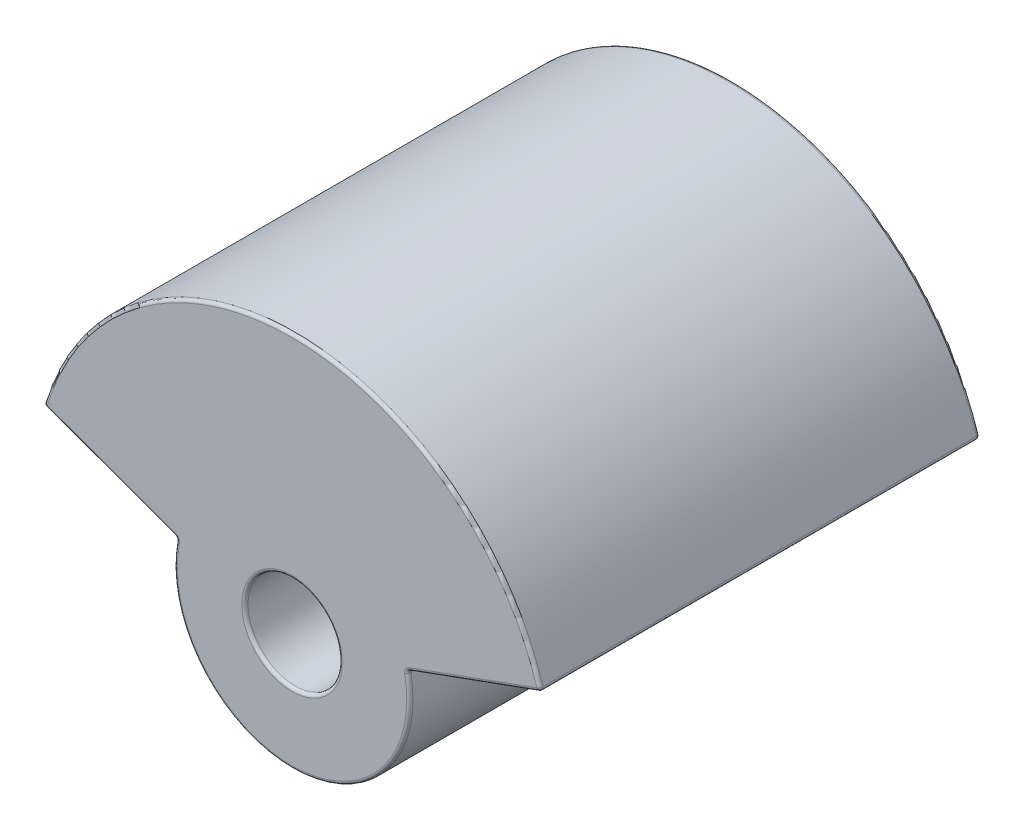
ISO-10303-21;
HEADER;
FILE_DESCRIPTION(('STEP AP214'),'2;1');
FILE_NAME('part.step','',(''),(''),'','','');
FILE_SCHEMA(('AUTOMOTIVE_DESIGN { 1 0 10303 214 1 1 1 1 }'));
ENDSEC;
DATA;
#1=APPLICATION_CONTEXT('core data for automotive mechanical design processes');
#2=APPLICATION_PROTOCOL_DEFINITION('international standard','automotive_design',2000,#1);
#3=PRODUCT_CONTEXT('',#1,'mechanical');
#4=PRODUCT('Part','Part','',(#3));
#5=PRODUCT_RELATED_PRODUCT_CATEGORY('part','',(#4));
#6=PRODUCT_DEFINITION_FORMATION('','',#4);
#7=PRODUCT_DEFINITION_CONTEXT('part definition',#1,'design');
#8=PRODUCT_DEFINITION('design','',#6,#7);
#9=PRODUCT_DEFINITION_SHAPE('','',#8);
#10=(LENGTH_UNIT() NAMED_UNIT(*) SI_UNIT(.MILLI.,.METRE.));
#11=(NAMED_UNIT(*) PLANE_ANGLE_UNIT() SI_UNIT($,.RADIAN.));
#12=(NAMED_UNIT(*) SI_UNIT($,.STERADIAN.) SOLID_ANGLE_UNIT());
#13=UNCERTAINTY_MEASURE_WITH_UNIT(LENGTH_MEASURE(1.E-05),#10,'distance_accuracy_value','');
#14=(GEOMETRIC_REPRESENTATION_CONTEXT(3) GLOBAL_UNCERTAINTY_ASSIGNED_CONTEXT((#13)) GLOBAL_UNIT_ASSIGNED_CONTEXT((#10,
#11,#12)) REPRESENTATION_CONTEXT('',''));
#15=CARTESIAN_POINT('',(0.,0.,0.));
#16=DIRECTION('',(0.,0.,1.));
#17=DIRECTION('',(1.,0.,0.));
#18=AXIS2_PLACEMENT_3D('',#15,#16,#17);
#19=CARTESIAN_POINT('',(0.,0.,0.));
#20=DIRECTION('',(0.,0.,1.));
#21=DIRECTION('',(1.,0.,0.));
#22=AXIS2_PLACEMENT_3D('',#19,#20,#21);
#23=PLANE('',#22);
#24=CARTESIAN_POINT('',(0.,0.,0.));
#25=DIRECTION('',(0.,0.,1.));
#26=DIRECTION('',(1.,0.,0.));
#27=AXIS2_PLACEMENT_3D('',#24,#25,#26);
#28=CIRCLE('',#27,0.32);
#29=CARTESIAN_POINT('',(0.32,0.,0.));
#30=VERTEX_POINT('',#29);
#31=EDGE_CURVE('E245',#30,#30,#28,.F.);
#32=ORIENTED_EDGE('',*,*,#31,.T.);
#33=EDGE_LOOP('',(#32));
#34=FACE_BOUND('',#33,.T.);
#35=CARTESIAN_POINT('',(-0.75626564218996,0.144783557225976,0.));
#36=DIRECTION('',(0.,0.,1.));
#37=DIRECTION('',(1.,0.,0.));
#38=AXIS2_PLACEMENT_3D('',#35,#36,#37);
#39=CIRCLE('',#38,0.04);
#40=CARTESIAN_POINT('',(-0.716979115322949,0.137262333473978,0.));
#41=VERTEX_POINT('',#40);
#42=CARTESIAN_POINT('',(-0.742584836456934,0.182371262057413,0.));
#43=VERTEX_POINT('',#42);
#44=EDGE_CURVE('E241',#41,#43,#39,.T.);
#45=ORIENTED_EDGE('',*,*,#44,.F.);
#46=CARTESIAN_POINT('',(0.,0.,0.));
#47=DIRECTION('',(0.,0.,1.));
#48=DIRECTION('',(1.,0.,0.));
#49=AXIS2_PLACEMENT_3D('',#46,#47,#48);
#50=CIRCLE('',#49,0.73);
#51=CARTESIAN_POINT('',(0.716979115322948,0.137262333473982,0.));
#52=VERTEX_POINT('',#51);
#53=EDGE_CURVE('E237',#41,#52,#50,.T.);
#54=ORIENTED_EDGE('',*,*,#53,.T.);
#55=CARTESIAN_POINT('',(0.756265642189959,0.144783557225981,0.));
#56=DIRECTION('',(0.,0.,1.));
#57=DIRECTION('',(1.,0.,0.));
#58=AXIS2_PLACEMENT_3D('',#55,#56,#57);
#59=CIRCLE('',#58,0.04);
#60=CARTESIAN_POINT('',(0.742584836456932,0.182371262057418,0.));
#61=VERTEX_POINT('',#60);
#62=EDGE_CURVE('E234',#61,#52,#59,.T.);
#63=ORIENTED_EDGE('',*,*,#62,.F.);
#64=DIRECTION('',(0.939692620785908,0.342020143325669,0.));
#65=VECTOR('',#64,1.);
#66=CARTESIAN_POINT('',(0.02825293066564,-0.0776242890372621,0.));
#67=LINE('',#66,#65);
#68=CARTESIAN_POINT('',(1.557983694628,0.479152175486335,0.));
#69=VERTEX_POINT('',#68);
#70=EDGE_CURVE('E231',#61,#69,#67,.T.);
#71=ORIENTED_EDGE('',*,*,#70,.T.);
#72=CARTESIAN_POINT('',(0.,0.,0.));
#73=DIRECTION('',(0.,0.,1.));
#74=DIRECTION('',(1.,0.,0.));
#75=AXIS2_PLACEMENT_3D('',#72,#73,#74);
#76=CIRCLE('',#75,1.63);
#77=CARTESIAN_POINT('',(-1.557983694628,0.479152175486324,0.));
#78=VERTEX_POINT('',#77);
#79=EDGE_CURVE('E225',#69,#78,#76,.T.);
#80=ORIENTED_EDGE('',*,*,#79,.T.);
#81=DIRECTION('',(0.939692620785911,-0.342020143325662,0.));
#82=VECTOR('',#81,1.);
#83=CARTESIAN_POINT('',(-0.0282529306656392,-0.0776242890372618,0.));
#84=LINE('',#83,#82);
#85=EDGE_CURVE('E228',#78,#43,#84,.T.);
#86=ORIENTED_EDGE('',*,*,#85,.T.);
#87=EDGE_LOOP('',(#45,#54,#63,#71,#80,#86));
#88=FACE_BOUND('',#87,.T.);
#89=ADVANCED_FACE('F42',(#34,#88),#23,.T.);
#90=CARTESIAN_POINT('',(0.,0.,-2.8));
#91=DIRECTION('',(0.,0.,1.));
#92=DIRECTION('',(1.,0.,0.));
#93=AXIS2_PLACEMENT_3D('',#90,#91,#92);
#94=PLANE('',#93);
#95=CARTESIAN_POINT('',(0.,0.,-2.8));
#96=DIRECTION('',(0.,0.,1.));
#97=DIRECTION('',(1.,0.,0.));
#98=AXIS2_PLACEMENT_3D('',#95,#96,#97);
#99=CIRCLE('',#98,0.32);
#100=CARTESIAN_POINT('',(0.32,0.,-2.8));
#101=VERTEX_POINT('',#100);
#102=EDGE_CURVE('E208',#101,#101,#99,.T.);
#103=ORIENTED_EDGE('',*,*,#102,.T.);
#104=EDGE_LOOP('',(#103));
#105=FACE_BOUND('',#104,.T.);
#106=CARTESIAN_POINT('',(0.756265642189959,0.144783557225981,-2.8));
#107=DIRECTION('',(0.,0.,1.));
#108=DIRECTION('',(1.,0.,0.));
#109=AXIS2_PLACEMENT_3D('',#106,#107,#108);
#110=CIRCLE('',#109,0.04);
#111=CARTESIAN_POINT('',(0.716979115322948,0.137262333473982,-2.8));
#112=VERTEX_POINT('',#111);
#113=CARTESIAN_POINT('',(0.742584836456932,0.182371262057418,-2.8));
#114=VERTEX_POINT('',#113);
#115=EDGE_CURVE('E205',#112,#114,#110,.F.);
#116=ORIENTED_EDGE('',*,*,#115,.F.);
#117=CARTESIAN_POINT('',(0.,0.,-2.8));
#118=DIRECTION('',(0.,0.,1.));
#119=DIRECTION('',(1.,0.,0.));
#120=AXIS2_PLACEMENT_3D('',#117,#118,#119);
#121=CIRCLE('',#120,0.73);
#122=CARTESIAN_POINT('',(-0.716979115322949,0.137262333473978,-2.8));
#123=VERTEX_POINT('',#122);
#124=EDGE_CURVE('E152',#112,#123,#121,.F.);
#125=ORIENTED_EDGE('',*,*,#124,.T.);
#126=CARTESIAN_POINT('',(-0.75626564218996,0.144783557225976,-2.8));
#127=DIRECTION('',(0.,0.,1.));
#128=DIRECTION('',(1.,0.,0.));
#129=AXIS2_PLACEMENT_3D('',#126,#127,#128);
#130=CIRCLE('',#129,0.04);
#131=CARTESIAN_POINT('',(-0.742584836456934,0.182371262057413,-2.8));
#132=VERTEX_POINT('',#131);
#133=EDGE_CURVE('E199',#132,#123,#130,.F.);
#134=ORIENTED_EDGE('',*,*,#133,.F.);
#135=DIRECTION('',(0.939692620785911,-0.342020143325662,0.));
#136=VECTOR('',#135,1.);
#137=CARTESIAN_POINT('',(-1.57574494686297,0.485616742623145,-2.8));
#138=LINE('',#137,#136);
#139=CARTESIAN_POINT('',(-1.557983694628,0.479152175486324,-2.8));
#140=VERTEX_POINT('',#139);
#141=EDGE_CURVE('E189',#132,#140,#138,.F.);
#142=ORIENTED_EDGE('',*,*,#141,.T.);
#143=CARTESIAN_POINT('',(0.,0.,-2.8));
#144=DIRECTION('',(0.,0.,1.));
#145=DIRECTION('',(1.,0.,0.));
#146=AXIS2_PLACEMENT_3D('',#143,#144,#145);
#147=CIRCLE('',#146,1.63);
#148=CARTESIAN_POINT('',(1.557983694628,0.479152175486335,-2.8));
#149=VERTEX_POINT('',#148);
#150=EDGE_CURVE('E185',#140,#149,#147,.F.);
#151=ORIENTED_EDGE('',*,*,#150,.T.);
#152=DIRECTION('',(0.939692620785908,0.342020143325669,0.));
#153=VECTOR('',#152,1.);
#154=CARTESIAN_POINT('',(0.726395854160511,0.176478954378458,-2.8));
#155=LINE('',#154,#153);
#156=EDGE_CURVE('E196',#149,#114,#155,.F.);
#157=ORIENTED_EDGE('',*,*,#156,.T.);
#158=EDGE_LOOP('',(#116,#125,#134,#142,#151,#157));
#159=FACE_BOUND('',#158,.T.);
#160=ADVANCED_FACE('F432',(#105,#159),#94,.F.);
#161=CARTESIAN_POINT('',(0.,0.,-2.8));
#162=DIRECTION('',(0.,0.,1.));
#163=DIRECTION('',(1.,0.,0.));
#164=AXIS2_PLACEMENT_3D('',#161,#162,#163);
#165=CYLINDRICAL_SURFACE('',#164,1.65);
#166=CARTESIAN_POINT('',(0.,0.,-0.0200000000000001));
#167=DIRECTION('',(0.,0.,1.));
#168=DIRECTION('',(1.,0.,0.));
#169=AXIS2_PLACEMENT_3D('',#166,#167,#168);
#170=CIRCLE('',#169,1.65);
#171=CARTESIAN_POINT('',(-1.57710005897927,0.485031343283702,-0.0200000000000001));
#172=VERTEX_POINT('',#171);
#173=CARTESIAN_POINT('',(1.57710005897926,0.485031343283714,-0.0200000000000001));
#174=VERTEX_POINT('',#173);
#175=EDGE_CURVE('E60',#172,#174,#170,.F.);
#176=ORIENTED_EDGE('',*,*,#175,.T.);
#177=DIRECTION('',(0.,0.,1.));
#178=VECTOR('',#177,1.);
#179=CARTESIAN_POINT('',(1.57710005897926,0.485031343283714,-2.8));
#180=LINE('',#179,#178);
#181=CARTESIAN_POINT('',(1.57710005897926,0.485031343283714,-2.78));
#182=VERTEX_POINT('',#181);
#183=EDGE_CURVE('E269',#174,#182,#180,.F.);
#184=ORIENTED_EDGE('',*,*,#183,.T.);
#185=CARTESIAN_POINT('',(0.,0.,-2.78));
#186=DIRECTION('',(0.,0.,1.));
#187=DIRECTION('',(1.,0.,0.));
#188=AXIS2_PLACEMENT_3D('',#185,#186,#187);
#189=CIRCLE('',#188,1.65);
#190=CARTESIAN_POINT('',(-1.57710005897927,0.485031343283702,-2.78));
#191=VERTEX_POINT('',#190);
#192=EDGE_CURVE('E262',#182,#191,#189,.T.);
#193=ORIENTED_EDGE('',*,*,#192,.T.);
#194=DIRECTION('',(0.,0.,1.));
#195=VECTOR('',#194,1.);
#196=CARTESIAN_POINT('',(-1.57710005897927,0.485031343283702,-2.8));
#197=LINE('',#196,#195);
#198=EDGE_CURVE('E65',#191,#172,#197,.T.);
#199=ORIENTED_EDGE('',*,*,#198,.T.);
#200=EDGE_LOOP('',(#176,#184,#193,#199));
#201=FACE_BOUND('',#200,.T.);
#202=ADVANCED_FACE('F386',(#201),#165,.T.);
#203=CARTESIAN_POINT('',(0.733236257027025,0.15768510196274,-2.8));
#204=DIRECTION('',(0.342020143325669,-0.939692620785908,0.));
#205=DIRECTION('',(0.939692620785908,0.342020143325669,0.));
#206=AXIS2_PLACEMENT_3D('',#203,#204,#205);
#207=PLANE('',#206);
#208=DIRECTION('',(0.939692620785908,0.342020143325669,0.));
#209=VECTOR('',#208,1.);
#210=CARTESIAN_POINT('',(1.58258534972948,0.466822890207438,-2.78));
#211=LINE('',#210,#209);
#212=CARTESIAN_POINT('',(0.749425239323446,0.1635774096417,-2.78));
#213=VERTEX_POINT('',#212);
#214=CARTESIAN_POINT('',(1.56482409749451,0.460358323070617,-2.78));
#215=VERTEX_POINT('',#214);
#216=EDGE_CURVE('E255',#213,#215,#211,.T.);
#217=ORIENTED_EDGE('',*,*,#216,.T.);
#218=DIRECTION('',(0.,0.,1.));
#219=VECTOR('',#218,1.);
#220=CARTESIAN_POINT('',(1.56482409749451,0.460358323070617,-2.8));
#221=LINE('',#220,#219);
#222=CARTESIAN_POINT('',(1.56482409749451,0.460358323070617,-0.02));
#223=VERTEX_POINT('',#222);
#224=EDGE_CURVE('E258',#215,#223,#221,.T.);
#225=ORIENTED_EDGE('',*,*,#224,.T.);
#226=DIRECTION('',(0.939692620785908,0.342020143325669,0.));
#227=VECTOR('',#226,1.);
#228=CARTESIAN_POINT('',(0.733236257027025,0.15768510196274,-0.0200000000000001));
#229=LINE('',#228,#227);
#230=CARTESIAN_POINT('',(0.749425239323446,0.1635774096417,-0.02));
#231=VERTEX_POINT('',#230);
#232=EDGE_CURVE('E249',#223,#231,#229,.F.);
#233=ORIENTED_EDGE('',*,*,#232,.T.);
#234=DIRECTION('',(0.,0.,-1.));
#235=VECTOR('',#234,1.);
#236=CARTESIAN_POINT('',(0.749425239323446,0.1635774096417,-2.8));
#237=LINE('',#236,#235);
#238=EDGE_CURVE('E252',#231,#213,#237,.T.);
#239=ORIENTED_EDGE('',*,*,#238,.T.);
#240=EDGE_LOOP('',(#217,#225,#233,#239));
#241=FACE_BOUND('',#240,.T.);
#242=ADVANCED_FACE('F417',(#241),#207,.T.);
#243=CARTESIAN_POINT('',(0.,0.,-2.8));
#244=DIRECTION('',(0.,0.,1.));
#245=DIRECTION('',(1.,0.,0.));
#246=AXIS2_PLACEMENT_3D('',#243,#244,#245);
#247=CYLINDRICAL_SURFACE('',#246,0.75);
#248=DIRECTION('',(0.,0.,1.));
#249=VECTOR('',#248,1.);
#250=CARTESIAN_POINT('',(-0.736622378756455,0.141022945349977,-2.8));
#251=LINE('',#250,#249);
#252=CARTESIAN_POINT('',(-0.736622378756455,0.141022945349977,-0.0200000000000001));
#253=VERTEX_POINT('',#252);
#254=CARTESIAN_POINT('',(-0.736622378756455,0.141022945349977,-2.78));
#255=VERTEX_POINT('',#254);
#256=EDGE_CURVE('E182',#253,#255,#251,.F.);
#257=ORIENTED_EDGE('',*,*,#256,.T.);
#258=CARTESIAN_POINT('',(0.,0.,-2.78));
#259=DIRECTION('',(0.,0.,1.));
#260=DIRECTION('',(1.,0.,0.));
#261=AXIS2_PLACEMENT_3D('',#258,#259,#260);
#262=CIRCLE('',#261,0.75);
#263=CARTESIAN_POINT('',(0.736622378756454,0.141022945349982,-2.78));
#264=VERTEX_POINT('',#263);
#265=EDGE_CURVE('E150',#255,#264,#262,.T.);
#266=ORIENTED_EDGE('',*,*,#265,.T.);
#267=DIRECTION('',(0.,0.,1.));
#268=VECTOR('',#267,1.);
#269=CARTESIAN_POINT('',(0.736622378756454,0.141022945349982,-2.8));
#270=LINE('',#269,#268);
#271=CARTESIAN_POINT('',(0.736622378756454,0.141022945349982,-0.0200000000000001));
#272=VERTEX_POINT('',#271);
#273=EDGE_CURVE('E171',#264,#272,#270,.T.);
#274=ORIENTED_EDGE('',*,*,#273,.T.);
#275=CARTESIAN_POINT('',(0.,0.,-0.0200000000000001));
#276=DIRECTION('',(0.,0.,1.));
#277=DIRECTION('',(1.,0.,0.));
#278=AXIS2_PLACEMENT_3D('',#275,#276,#277);
#279=CIRCLE('',#278,0.75);
#280=EDGE_CURVE('E178',#272,#253,#279,.F.);
#281=ORIENTED_EDGE('',*,*,#280,.T.);
#282=EDGE_LOOP('',(#257,#266,#274,#281));
#283=FACE_BOUND('',#282,.T.);
#284=ADVANCED_FACE('F180',(#283),#247,.T.);
#285=CARTESIAN_POINT('',(-0.733236257027026,0.157685101962735,-2.8));
#286=DIRECTION('',(-0.342020143325662,-0.939692620785911,0.));
#287=DIRECTION('',(0.939692620785911,-0.342020143325662,0.));
#288=AXIS2_PLACEMENT_3D('',#285,#286,#287);
#289=PLANE('',#288);
#290=DIRECTION('',(0.939692620785911,-0.342020143325662,0.));
#291=VECTOR('',#290,1.);
#292=CARTESIAN_POINT('',(-0.733236257027026,0.157685101962735,-2.78));
#293=LINE('',#292,#291);
#294=CARTESIAN_POINT('',(-1.56482409749452,0.460358323070606,-2.78));
#295=VERTEX_POINT('',#294);
#296=CARTESIAN_POINT('',(-0.749425239323447,0.163577409641695,-2.78));
#297=VERTEX_POINT('',#296);
#298=EDGE_CURVE('E212',#295,#297,#293,.T.);
#299=ORIENTED_EDGE('',*,*,#298,.T.);
#300=DIRECTION('',(0.,0.,-1.));
#301=VECTOR('',#300,1.);
#302=CARTESIAN_POINT('',(-0.749425239323447,0.163577409641695,0.));
#303=LINE('',#302,#301);
#304=CARTESIAN_POINT('',(-0.749425239323447,0.163577409641695,-0.02));
#305=VERTEX_POINT('',#304);
#306=EDGE_CURVE('E221',#297,#305,#303,.F.);
#307=ORIENTED_EDGE('',*,*,#306,.T.);
#308=DIRECTION('',(0.939692620785911,-0.342020143325662,0.));
#309=VECTOR('',#308,1.);
#310=CARTESIAN_POINT('',(-0.733236257027026,0.157685101962735,-0.0200000000000001));
#311=LINE('',#310,#309);
#312=CARTESIAN_POINT('',(-1.56482409749452,0.460358323070606,-0.02));
#313=VERTEX_POINT('',#312);
#314=EDGE_CURVE('E218',#305,#313,#311,.F.);
#315=ORIENTED_EDGE('',*,*,#314,.T.);
#316=DIRECTION('',(0.,0.,1.));
#317=VECTOR('',#316,1.);
#318=CARTESIAN_POINT('',(-1.56482409749452,0.460358323070606,-2.8));
#319=LINE('',#318,#317);
#320=EDGE_CURVE('E215',#313,#295,#319,.F.);
#321=ORIENTED_EDGE('',*,*,#320,.T.);
#322=EDGE_LOOP('',(#299,#307,#315,#321));
#323=FACE_BOUND('',#322,.T.);
#324=ADVANCED_FACE('F368',(#323),#289,.T.);
#325=CARTESIAN_POINT('',(0.,0.,-2.8));
#326=DIRECTION('',(0.,0.,1.));
#327=DIRECTION('',(1.,0.,0.));
#328=AXIS2_PLACEMENT_3D('',#325,#326,#327);
#329=CYLINDRICAL_SURFACE('',#328,0.3);
#330=CARTESIAN_POINT('',(0.,0.,-0.0200000000000001));
#331=DIRECTION('',(0.,0.,1.));
#332=DIRECTION('',(1.,0.,0.));
#333=AXIS2_PLACEMENT_3D('',#330,#331,#332);
#334=CIRCLE('',#333,0.3);
#335=CARTESIAN_POINT('',(0.3,0.,-0.0200000000000001));
#336=VERTEX_POINT('',#335);
#337=EDGE_CURVE('E11',#336,#336,#334,.T.);
#338=ORIENTED_EDGE('',*,*,#337,.T.);
#339=EDGE_LOOP('',(#338));
#340=FACE_BOUND('',#339,.T.);
#341=CARTESIAN_POINT('',(0.,0.,-2.78));
#342=DIRECTION('',(0.,0.,1.));
#343=DIRECTION('',(1.,0.,0.));
#344=AXIS2_PLACEMENT_3D('',#341,#342,#343);
#345=CIRCLE('',#344,0.3);
#346=CARTESIAN_POINT('',(0.3,0.,-2.78));
#347=VERTEX_POINT('',#346);
#348=EDGE_CURVE('E52',#347,#347,#345,.F.);
#349=ORIENTED_EDGE('',*,*,#348,.T.);
#350=EDGE_LOOP('',(#349));
#351=FACE_BOUND('',#350,.T.);
#352=ADVANCED_FACE('F448',(#340,#351),#329,.F.);
#353=CARTESIAN_POINT('',(0.,0.,-0.0200000000000001));
#354=DIRECTION('',(0.,0.,1.));
#355=DIRECTION('',(1.,0.,0.));
#356=AXIS2_PLACEMENT_3D('',#353,#354,#355);
#357=TOROIDAL_SURFACE('',#356,1.63,0.02);
#358=CARTESIAN_POINT('',(-1.557983694628,0.479152175486324,-0.02));
#359=DIRECTION('',(-0.293958389868907,-0.955818217563193,0.));
#360=DIRECTION('',(0.955818217563193,-0.293958389868907,0.));
#361=AXIS2_PLACEMENT_3D('',#358,#359,#360);
#362=CIRCLE('',#361,0.02);
#363=EDGE_CURVE('E46',#78,#172,#362,.T.);
#364=ORIENTED_EDGE('',*,*,#363,.F.);
#365=ORIENTED_EDGE('',*,*,#79,.F.);
#366=CARTESIAN_POINT('',(1.557983694628,0.479152175486335,-0.0200000000000001));
#367=DIRECTION('',(0.293958389868917,-0.95581821756319,0.));
#368=DIRECTION('',(0.95581821756319,0.293958389868917,0.));
#369=AXIS2_PLACEMENT_3D('',#366,#367,#368);
#370=CIRCLE('',#369,0.02);
#371=EDGE_CURVE('E345',#174,#69,#370,.T.);
#372=ORIENTED_EDGE('',*,*,#371,.F.);
#373=ORIENTED_EDGE('',*,*,#175,.F.);
#374=EDGE_LOOP('',(#364,#365,#372,#373));
#375=FACE_BOUND('',#374,.T.);
#376=ADVANCED_FACE('F378',(#375),#357,.T.);
#377=CARTESIAN_POINT('',(-1.557983694628,0.479152175486324,-0.02));
#378=DIRECTION('',(0.,0.,1.));
#379=DIRECTION('',(0.,-1.,0.));
#380=AXIS2_PLACEMENT_3D('',#377,#378,#379);
#381=SPHERICAL_SURFACE('',#380,0.02);
#382=CARTESIAN_POINT('',(-1.557983694628,0.479152175486324,-0.02));
#383=DIRECTION('',(-0.93969262078591,0.342020143325665,0.));
#384=DIRECTION('',(-0.342020143325665,-0.93969262078591,0.));
#385=AXIS2_PLACEMENT_3D('',#382,#383,#384);
#386=CIRCLE('',#385,0.02);
#387=EDGE_CURVE('E338',#78,#313,#386,.F.);
#388=ORIENTED_EDGE('',*,*,#387,.F.);
#389=ORIENTED_EDGE('',*,*,#363,.T.);
#390=CARTESIAN_POINT('',(-1.557983694628,0.479152175486324,-0.0200000000000001));
#391=DIRECTION('',(0.,0.,1.));
#392=DIRECTION('',(0.,-1.,0.));
#393=AXIS2_PLACEMENT_3D('',#390,#391,#392);
#394=CIRCLE('',#393,0.02);
#395=EDGE_CURVE('E342',#313,#172,#394,.F.);
#396=ORIENTED_EDGE('',*,*,#395,.F.);
#397=EDGE_LOOP('',(#388,#389,#396));
#398=FACE_BOUND('',#397,.T.);
#399=ADVANCED_FACE('F357',(#398),#381,.T.);
#400=CARTESIAN_POINT('',(1.557983694628,0.479152175486335,-0.02));
#401=DIRECTION('',(0.,0.,1.));
#402=DIRECTION('',(0.,-1.,0.));
#403=AXIS2_PLACEMENT_3D('',#400,#401,#402);
#404=SPHERICAL_SURFACE('',#403,0.02);
#405=CARTESIAN_POINT('',(1.557983694628,0.479152175486335,-0.02));
#406=DIRECTION('',(0.,0.,1.));
#407=DIRECTION('',(1.,0.,0.));
#408=AXIS2_PLACEMENT_3D('',#405,#406,#407);
#409=CIRCLE('',#408,0.02);
#410=EDGE_CURVE('E330',#174,#223,#409,.F.);
#411=ORIENTED_EDGE('',*,*,#410,.F.);
#412=ORIENTED_EDGE('',*,*,#371,.T.);
#413=CARTESIAN_POINT('',(1.557983694628,0.479152175486335,-0.02));
#414=DIRECTION('',(0.939692620785914,0.342020143325654,0.));
#415=DIRECTION('',(-0.342020143325654,0.939692620785914,0.));
#416=AXIS2_PLACEMENT_3D('',#413,#414,#415);
#417=CIRCLE('',#416,0.02);
#418=EDGE_CURVE('E334',#223,#69,#417,.F.);
#419=ORIENTED_EDGE('',*,*,#418,.F.);
#420=EDGE_LOOP('',(#411,#412,#419));
#421=FACE_BOUND('',#420,.T.);
#422=ADVANCED_FACE('F380',(#421),#404,.T.);
#423=CARTESIAN_POINT('',(-1.557983694628,0.479152175486324,-2.8));
#424=DIRECTION('',(0.,0.,1.));
#425=DIRECTION('',(1.,0.,0.));
#426=AXIS2_PLACEMENT_3D('',#423,#424,#425);
#427=CYLINDRICAL_SURFACE('',#426,0.02);
#428=ORIENTED_EDGE('',*,*,#395,.T.);
#429=ORIENTED_EDGE('',*,*,#198,.F.);
#430=CARTESIAN_POINT('',(-1.557983694628,0.479152175486324,-2.78));
#431=DIRECTION('',(0.,0.,-1.));
#432=DIRECTION('',(-1.,0.,0.));
#433=AXIS2_PLACEMENT_3D('',#430,#431,#432);
#434=CIRCLE('',#433,0.02);
#435=EDGE_CURVE('E322',#295,#191,#434,.T.);
#436=ORIENTED_EDGE('',*,*,#435,.F.);
#437=ORIENTED_EDGE('',*,*,#320,.F.);
#438=EDGE_LOOP('',(#428,#429,#436,#437));
#439=FACE_BOUND('',#438,.T.);
#440=ADVANCED_FACE('F363',(#439),#427,.T.);
#441=CARTESIAN_POINT('',(-0.0282529306656392,-0.0776242890372618,-0.02));
#442=DIRECTION('',(0.939692620785911,-0.342020143325662,0.));
#443=DIRECTION('',(0.342020143325662,0.939692620785911,0.));
#444=AXIS2_PLACEMENT_3D('',#441,#442,#443);
#445=CYLINDRICAL_SURFACE('',#444,0.02);
#446=ORIENTED_EDGE('',*,*,#387,.T.);
#447=ORIENTED_EDGE('',*,*,#314,.F.);
#448=CARTESIAN_POINT('',(-0.742584836456934,0.182371262057413,-0.02));
#449=DIRECTION('',(0.93969262078591,-0.342020143325664,0.));
#450=DIRECTION('',(0.342020143325664,0.93969262078591,0.));
#451=AXIS2_PLACEMENT_3D('',#448,#449,#450);
#452=CIRCLE('',#451,0.02);
#453=EDGE_CURVE('E318',#43,#305,#452,.T.);
#454=ORIENTED_EDGE('',*,*,#453,.F.);
#455=ORIENTED_EDGE('',*,*,#85,.F.);
#456=EDGE_LOOP('',(#446,#447,#454,#455));
#457=FACE_BOUND('',#456,.T.);
#458=ADVANCED_FACE('F374',(#457),#445,.T.);
#459=CARTESIAN_POINT('',(0.,0.,-0.0200000000000001));
#460=DIRECTION('',(0.,0.,1.));
#461=DIRECTION('',(1.,0.,0.));
#462=AXIS2_PLACEMENT_3D('',#459,#460,#461);
#463=TOROIDAL_SURFACE('',#462,0.73,0.02);
#464=CARTESIAN_POINT('',(0.716979115322948,0.137262333473982,-0.02));
#465=DIRECTION('',(-0.188030593799975,0.982163171675272,0.));
#466=DIRECTION('',(-0.982163171675272,-0.188030593799975,0.));
#467=AXIS2_PLACEMENT_3D('',#464,#465,#466);
#468=CIRCLE('',#467,0.02);
#469=EDGE_CURVE('E310',#52,#272,#468,.T.);
#470=ORIENTED_EDGE('',*,*,#469,.F.);
#471=ORIENTED_EDGE('',*,*,#53,.F.);
#472=CARTESIAN_POINT('',(-0.716979115322949,0.137262333473978,-0.0200000000000001));
#473=DIRECTION('',(0.188030593799968,0.982163171675273,0.));
#474=DIRECTION('',(-0.982163171675273,0.188030593799968,0.));
#475=AXIS2_PLACEMENT_3D('',#472,#473,#474);
#476=CIRCLE('',#475,0.02);
#477=EDGE_CURVE('E314',#253,#41,#476,.T.);
#478=ORIENTED_EDGE('',*,*,#477,.F.);
#479=ORIENTED_EDGE('',*,*,#280,.F.);
#480=EDGE_LOOP('',(#470,#471,#478,#479));
#481=FACE_BOUND('',#480,.T.);
#482=ADVANCED_FACE('F409',(#481),#463,.T.);
#483=CARTESIAN_POINT('',(0.02825293066564,-0.0776242890372621,-0.02));
#484=DIRECTION('',(0.939692620785908,0.342020143325669,0.));
#485=DIRECTION('',(-0.342020143325669,0.939692620785908,0.));
#486=AXIS2_PLACEMENT_3D('',#483,#484,#485);
#487=CYLINDRICAL_SURFACE('',#486,0.02);
#488=ORIENTED_EDGE('',*,*,#418,.T.);
#489=ORIENTED_EDGE('',*,*,#70,.F.);
#490=CARTESIAN_POINT('',(0.742584836456932,0.182371262057418,-0.02));
#491=DIRECTION('',(-0.939692620785908,-0.34202014332567,0.));
#492=DIRECTION('',(0.34202014332567,-0.939692620785908,0.));
#493=AXIS2_PLACEMENT_3D('',#490,#491,#492);
#494=CIRCLE('',#493,0.02);
#495=EDGE_CURVE('E306',#231,#61,#494,.T.);
#496=ORIENTED_EDGE('',*,*,#495,.F.);
#497=ORIENTED_EDGE('',*,*,#232,.F.);
#498=EDGE_LOOP('',(#488,#489,#496,#497));
#499=FACE_BOUND('',#498,.T.);
#500=ADVANCED_FACE('F413',(#499),#487,.T.);
#501=CARTESIAN_POINT('',(1.557983694628,0.479152175486335,-2.8));
#502=DIRECTION('',(0.,0.,1.));
#503=DIRECTION('',(1.,0.,0.));
#504=AXIS2_PLACEMENT_3D('',#501,#502,#503);
#505=CYLINDRICAL_SURFACE('',#504,0.02);
#506=ORIENTED_EDGE('',*,*,#410,.T.);
#507=ORIENTED_EDGE('',*,*,#224,.F.);
#508=CARTESIAN_POINT('',(1.557983694628,0.479152175486335,-2.78));
#509=DIRECTION('',(0.,0.,-1.));
#510=DIRECTION('',(-1.,0.,0.));
#511=AXIS2_PLACEMENT_3D('',#508,#509,#510);
#512=CIRCLE('',#511,0.02);
#513=EDGE_CURVE('E302',#182,#215,#512,.T.);
#514=ORIENTED_EDGE('',*,*,#513,.F.);
#515=ORIENTED_EDGE('',*,*,#183,.F.);
#516=EDGE_LOOP('',(#506,#507,#514,#515));
#517=FACE_BOUND('',#516,.T.);
#518=ADVANCED_FACE('F384',(#517),#505,.T.);
#519=CARTESIAN_POINT('',(0.,0.,-2.78));
#520=DIRECTION('',(0.,0.,1.));
#521=DIRECTION('',(1.,0.,0.));
#522=AXIS2_PLACEMENT_3D('',#519,#520,#521);
#523=TOROIDAL_SURFACE('',#522,1.63,0.02);
#524=CARTESIAN_POINT('',(-1.557983694628,0.479152175486324,-2.78));
#525=DIRECTION('',(-0.29395838986891,-0.955818217563192,0.));
#526=DIRECTION('',(0.955818217563192,-0.29395838986891,0.));
#527=AXIS2_PLACEMENT_3D('',#524,#525,#526);
#528=CIRCLE('',#527,0.02);
#529=EDGE_CURVE('E326',#191,#140,#528,.T.);
#530=ORIENTED_EDGE('',*,*,#529,.F.);
#531=ORIENTED_EDGE('',*,*,#192,.F.);
#532=CARTESIAN_POINT('',(1.557983694628,0.479152175486335,-2.78));
#533=DIRECTION('',(0.293958389868917,-0.95581821756319,0.));
#534=DIRECTION('',(0.95581821756319,0.293958389868917,0.));
#535=AXIS2_PLACEMENT_3D('',#532,#533,#534);
#536=CIRCLE('',#535,0.02);
#537=EDGE_CURVE('E299',#149,#182,#536,.T.);
#538=ORIENTED_EDGE('',*,*,#537,.F.);
#539=ORIENTED_EDGE('',*,*,#150,.F.);
#540=EDGE_LOOP('',(#530,#531,#538,#539));
#541=FACE_BOUND('',#540,.T.);
#542=ADVANCED_FACE('F389',(#541),#523,.T.);
#543=CARTESIAN_POINT('',(-1.557983694628,0.479152175486324,-2.78));
#544=DIRECTION('',(0.,0.,-1.));
#545=DIRECTION('',(0.,1.,0.));
#546=AXIS2_PLACEMENT_3D('',#543,#544,#545);
#547=SPHERICAL_SURFACE('',#546,0.02);
#548=ORIENTED_EDGE('',*,*,#435,.T.);
#549=ORIENTED_EDGE('',*,*,#529,.T.);
#550=CARTESIAN_POINT('',(-1.557983694628,0.479152175486324,-2.78));
#551=DIRECTION('',(-0.93969262078591,0.342020143325664,0.));
#552=DIRECTION('',(-0.342020143325664,-0.93969262078591,0.));
#553=AXIS2_PLACEMENT_3D('',#550,#551,#552);
#554=CIRCLE('',#553,0.02);
#555=EDGE_CURVE('E295',#295,#140,#554,.F.);
#556=ORIENTED_EDGE('',*,*,#555,.F.);
#557=EDGE_LOOP('',(#548,#549,#556));
#558=FACE_BOUND('',#557,.T.);
#559=ADVANCED_FACE('F393',(#558),#547,.T.);
#560=CARTESIAN_POINT('',(-0.75626564218996,0.144783557225976,-0.0200000000000001));
#561=DIRECTION('',(0.,0.,1.));
#562=DIRECTION('',(1.,0.,0.));
#563=AXIS2_PLACEMENT_3D('',#560,#561,#562);
#564=TOROIDAL_SURFACE('',#563,0.04,0.02);
#565=ORIENTED_EDGE('',*,*,#44,.T.);
#566=ORIENTED_EDGE('',*,*,#453,.T.);
#567=CARTESIAN_POINT('',(-0.75626564218996,0.144783557225976,-0.0200000000000001));
#568=DIRECTION('',(0.,0.,1.));
#569=DIRECTION('',(1.,0.,0.));
#570=AXIS2_PLACEMENT_3D('',#567,#568,#569);
#571=CIRCLE('',#570,0.02);
#572=EDGE_CURVE('E292',#253,#305,#571,.T.);
#573=ORIENTED_EDGE('',*,*,#572,.F.);
#574=ORIENTED_EDGE('',*,*,#477,.T.);
#575=EDGE_LOOP('',(#565,#566,#573,#574));
#576=FACE_BOUND('',#575,.T.);
#577=ADVANCED_FACE('F405',(#576),#564,.T.);
#578=CARTESIAN_POINT('',(0.756265642189959,0.144783557225981,-0.0200000000000001));
#579=DIRECTION('',(0.,0.,1.));
#580=DIRECTION('',(1.,0.,0.));
#581=AXIS2_PLACEMENT_3D('',#578,#579,#580);
#582=TOROIDAL_SURFACE('',#581,0.04,0.02);
#583=ORIENTED_EDGE('',*,*,#62,.T.);
#584=ORIENTED_EDGE('',*,*,#469,.T.);
#585=CARTESIAN_POINT('',(0.756265642189959,0.144783557225981,-0.0200000000000001));
#586=DIRECTION('',(0.,0.,1.));
#587=DIRECTION('',(1.,0.,0.));
#588=AXIS2_PLACEMENT_3D('',#585,#586,#587);
#589=CIRCLE('',#588,0.02);
#590=EDGE_CURVE('E174',#231,#272,#589,.T.);
#591=ORIENTED_EDGE('',*,*,#590,.F.);
#592=ORIENTED_EDGE('',*,*,#495,.T.);
#593=EDGE_LOOP('',(#583,#584,#591,#592));
#594=FACE_BOUND('',#593,.T.);
#595=ADVANCED_FACE('F414',(#594),#582,.T.);
#596=CARTESIAN_POINT('',(1.557983694628,0.479152175486335,-2.78));
#597=DIRECTION('',(0.,0.,-1.));
#598=DIRECTION('',(-1.,0.,0.));
#599=AXIS2_PLACEMENT_3D('',#596,#597,#598);
#600=SPHERICAL_SURFACE('',#599,0.02);
#601=ORIENTED_EDGE('',*,*,#537,.T.);
#602=ORIENTED_EDGE('',*,*,#513,.T.);
#603=CARTESIAN_POINT('',(1.557983694628,0.479152175486335,-2.78));
#604=DIRECTION('',(0.93969262078591,0.342020143325665,0.));
#605=DIRECTION('',(-0.342020143325665,0.93969262078591,0.));
#606=AXIS2_PLACEMENT_3D('',#603,#604,#605);
#607=CIRCLE('',#606,0.02);
#608=EDGE_CURVE('E286',#149,#215,#607,.F.);
#609=ORIENTED_EDGE('',*,*,#608,.F.);
#610=EDGE_LOOP('',(#601,#602,#609));
#611=FACE_BOUND('',#610,.T.);
#612=ADVANCED_FACE('F422',(#611),#600,.T.);
#613=CARTESIAN_POINT('',(-0.726395854160512,0.176478954378453,-2.78));
#614=DIRECTION('',(-0.939692620785911,0.342020143325662,0.));
#615=DIRECTION('',(-0.342020143325662,-0.939692620785911,0.));
#616=AXIS2_PLACEMENT_3D('',#613,#614,#615);
#617=CYLINDRICAL_SURFACE('',#616,0.02);
#618=ORIENTED_EDGE('',*,*,#555,.T.);
#619=ORIENTED_EDGE('',*,*,#141,.F.);
#620=CARTESIAN_POINT('',(-0.742584836456934,0.182371262057413,-2.78));
#621=DIRECTION('',(0.93969262078591,-0.342020143325664,0.));
#622=DIRECTION('',(0.342020143325665,0.93969262078591,0.));
#623=AXIS2_PLACEMENT_3D('',#620,#621,#622);
#624=CIRCLE('',#623,0.02);
#625=EDGE_CURVE('E282',#297,#132,#624,.T.);
#626=ORIENTED_EDGE('',*,*,#625,.F.);
#627=ORIENTED_EDGE('',*,*,#298,.F.);
#628=EDGE_LOOP('',(#618,#619,#626,#627));
#629=FACE_BOUND('',#628,.T.);
#630=ADVANCED_FACE('F397',(#629),#617,.T.);
#631=CARTESIAN_POINT('',(-0.75626564218996,0.144783557225976,-2.8));
#632=DIRECTION('',(0.,0.,1.));
#633=DIRECTION('',(1.,0.,0.));
#634=AXIS2_PLACEMENT_3D('',#631,#632,#633);
#635=CYLINDRICAL_SURFACE('',#634,0.02);
#636=ORIENTED_EDGE('',*,*,#572,.T.);
#637=ORIENTED_EDGE('',*,*,#306,.F.);
#638=CARTESIAN_POINT('',(-0.75626564218996,0.144783557225976,-2.78));
#639=DIRECTION('',(0.,0.,1.));
#640=DIRECTION('',(1.,0.,0.));
#641=AXIS2_PLACEMENT_3D('',#638,#639,#640);
#642=CIRCLE('',#641,0.02);
#643=EDGE_CURVE('E168',#255,#297,#642,.T.);
#644=ORIENTED_EDGE('',*,*,#643,.F.);
#645=ORIENTED_EDGE('',*,*,#256,.F.);
#646=EDGE_LOOP('',(#636,#637,#644,#645));
#647=FACE_BOUND('',#646,.T.);
#648=ADVANCED_FACE('F402',(#647),#635,.F.);
#649=CARTESIAN_POINT('',(0.756265642189959,0.144783557225981,-2.8));
#650=DIRECTION('',(0.,0.,1.));
#651=DIRECTION('',(1.,0.,0.));
#652=AXIS2_PLACEMENT_3D('',#649,#650,#651);
#653=CYLINDRICAL_SURFACE('',#652,0.02);
#654=ORIENTED_EDGE('',*,*,#590,.T.);
#655=ORIENTED_EDGE('',*,*,#273,.F.);
#656=CARTESIAN_POINT('',(0.756265642189959,0.144783557225981,-2.78));
#657=DIRECTION('',(0.,0.,1.));
#658=DIRECTION('',(1.,0.,0.));
#659=AXIS2_PLACEMENT_3D('',#656,#657,#658);
#660=CIRCLE('',#659,0.02);
#661=EDGE_CURVE('E160',#213,#264,#660,.T.);
#662=ORIENTED_EDGE('',*,*,#661,.F.);
#663=ORIENTED_EDGE('',*,*,#238,.F.);
#664=EDGE_LOOP('',(#654,#655,#662,#663));
#665=FACE_BOUND('',#664,.T.);
#666=ADVANCED_FACE('F172',(#665),#653,.F.);
#667=CARTESIAN_POINT('',(0.726395854160511,0.176478954378458,-2.78));
#668=DIRECTION('',(-0.939692620785908,-0.342020143325669,0.));
#669=DIRECTION('',(0.342020143325669,-0.939692620785908,0.));
#670=AXIS2_PLACEMENT_3D('',#667,#668,#669);
#671=CYLINDRICAL_SURFACE('',#670,0.02);
#672=ORIENTED_EDGE('',*,*,#608,.T.);
#673=ORIENTED_EDGE('',*,*,#216,.F.);
#674=CARTESIAN_POINT('',(0.742584836456932,0.182371262057418,-2.78));
#675=DIRECTION('',(-0.939692620785908,-0.34202014332567,0.));
#676=DIRECTION('',(0.34202014332567,-0.939692620785908,0.));
#677=AXIS2_PLACEMENT_3D('',#674,#675,#676);
#678=CIRCLE('',#677,0.02);
#679=EDGE_CURVE('E164',#114,#213,#678,.T.);
#680=ORIENTED_EDGE('',*,*,#679,.F.);
#681=ORIENTED_EDGE('',*,*,#156,.F.);
#682=EDGE_LOOP('',(#672,#673,#680,#681));
#683=FACE_BOUND('',#682,.T.);
#684=ADVANCED_FACE('F419',(#683),#671,.T.);
#685=CARTESIAN_POINT('',(-0.75626564218996,0.144783557225976,-2.78));
#686=DIRECTION('',(0.,0.,1.));
#687=DIRECTION('',(1.,0.,0.));
#688=AXIS2_PLACEMENT_3D('',#685,#686,#687);
#689=TOROIDAL_SURFACE('',#688,0.04,0.02);
#690=ORIENTED_EDGE('',*,*,#625,.T.);
#691=ORIENTED_EDGE('',*,*,#133,.T.);
#692=CARTESIAN_POINT('',(-0.716979115322949,0.137262333473978,-2.78));
#693=DIRECTION('',(0.188030593799969,0.982163171675273,0.));
#694=DIRECTION('',(-0.982163171675273,0.188030593799969,0.));
#695=AXIS2_PLACEMENT_3D('',#692,#693,#694);
#696=CIRCLE('',#695,0.02);
#697=EDGE_CURVE('E156',#255,#123,#696,.F.);
#698=ORIENTED_EDGE('',*,*,#697,.F.);
#699=ORIENTED_EDGE('',*,*,#643,.T.);
#700=EDGE_LOOP('',(#690,#691,#698,#699));
#701=FACE_BOUND('',#700,.T.);
#702=ADVANCED_FACE('F400',(#701),#689,.T.);
#703=CARTESIAN_POINT('',(0.756265642189959,0.144783557225981,-2.78));
#704=DIRECTION('',(0.,0.,1.));
#705=DIRECTION('',(1.,0.,0.));
#706=AXIS2_PLACEMENT_3D('',#703,#704,#705);
#707=TOROIDAL_SURFACE('',#706,0.04,0.02);
#708=ORIENTED_EDGE('',*,*,#679,.T.);
#709=ORIENTED_EDGE('',*,*,#661,.T.);
#710=CARTESIAN_POINT('',(0.716979115322948,0.137262333473982,-2.78));
#711=DIRECTION('',(-0.188030593799975,0.982163171675272,0.));
#712=DIRECTION('',(-0.982163171675272,-0.188030593799975,0.));
#713=AXIS2_PLACEMENT_3D('',#710,#711,#712);
#714=CIRCLE('',#713,0.02);
#715=EDGE_CURVE('E146',#112,#264,#714,.F.);
#716=ORIENTED_EDGE('',*,*,#715,.F.);
#717=ORIENTED_EDGE('',*,*,#115,.T.);
#718=EDGE_LOOP('',(#708,#709,#716,#717));
#719=FACE_BOUND('',#718,.T.);
#720=ADVANCED_FACE('F162',(#719),#707,.T.);
#721=CARTESIAN_POINT('',(0.,0.,-2.78));
#722=DIRECTION('',(0.,0.,1.));
#723=DIRECTION('',(1.,0.,0.));
#724=AXIS2_PLACEMENT_3D('',#721,#722,#723);
#725=TOROIDAL_SURFACE('',#724,0.73,0.02);
#726=ORIENTED_EDGE('',*,*,#697,.T.);
#727=ORIENTED_EDGE('',*,*,#124,.F.);
#728=ORIENTED_EDGE('',*,*,#715,.T.);
#729=ORIENTED_EDGE('',*,*,#265,.F.);
#730=EDGE_LOOP('',(#726,#727,#728,#729));
#731=FACE_BOUND('',#730,.T.);
#732=ADVANCED_FACE('F148',(#731),#725,.T.);
#733=CARTESIAN_POINT('',(0.,0.,-0.0200000000000001));
#734=DIRECTION('',(0.,0.,1.));
#735=DIRECTION('',(1.,0.,0.));
#736=AXIS2_PLACEMENT_3D('',#733,#734,#735);
#737=TOROIDAL_SURFACE('',#736,0.32,0.02);
#738=ORIENTED_EDGE('',*,*,#31,.F.);
#739=EDGE_LOOP('',(#738));
#740=FACE_BOUND('',#739,.T.);
#741=ORIENTED_EDGE('',*,*,#337,.F.);
#742=EDGE_LOOP('',(#741));
#743=FACE_BOUND('',#742,.T.);
#744=ADVANCED_FACE('F453',(#740,#743),#737,.T.);
#745=CARTESIAN_POINT('',(0.,0.,-2.78));
#746=DIRECTION('',(0.,0.,1.));
#747=DIRECTION('',(1.,0.,0.));
#748=AXIS2_PLACEMENT_3D('',#745,#746,#747);
#749=TOROIDAL_SURFACE('',#748,0.32,0.02);
#750=ORIENTED_EDGE('',*,*,#348,.F.);
#751=EDGE_LOOP('',(#750));
#752=FACE_BOUND('',#751,.T.);
#753=ORIENTED_EDGE('',*,*,#102,.F.);
#754=EDGE_LOOP('',(#753));
#755=FACE_BOUND('',#754,.T.);
#756=ADVANCED_FACE('F44',(#752,#755),#749,.T.);
#757=CLOSED_SHELL('',(#89,#160,#202,#242,#284,#324,#352,#376,#399,#422,#440,#458,#482,#500,#518,
#542,#559,#577,#595,#612,#630,#648,#666,#684,#702,#720,#732,#744,#756));
#758=MANIFOLD_SOLID_BREP('B2',#757);
#759=ADVANCED_BREP_SHAPE_REPRESENTATION('',(#18,#758),#14);
#760=SHAPE_DEFINITION_REPRESENTATION(#9,#759);
ENDSEC;
END-ISO-10303-21;
